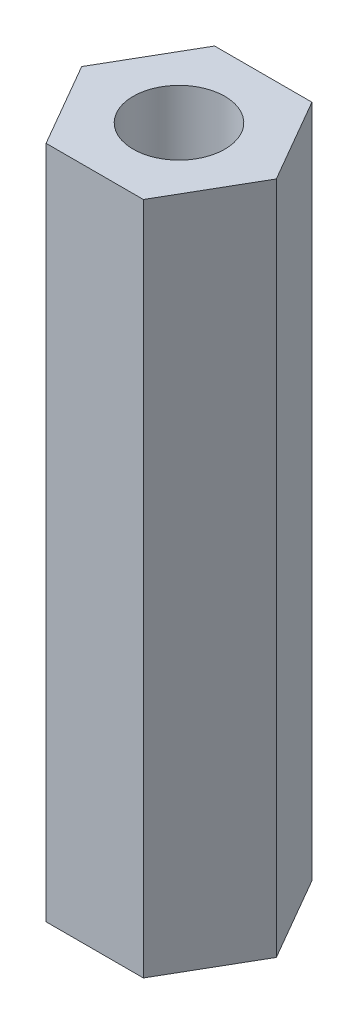
ISO-10303-21;
HEADER;
FILE_DESCRIPTION(('STEP AP214'),'2;1');
FILE_NAME('part.step','',(''),(''),'','','');
FILE_SCHEMA(('AUTOMOTIVE_DESIGN { 1 0 10303 214 1 1 1 1 }'));
ENDSEC;
DATA;
#1=APPLICATION_CONTEXT('core data for automotive mechanical design processes');
#2=APPLICATION_PROTOCOL_DEFINITION('international standard','automotive_design',2000,#1);
#3=PRODUCT_CONTEXT('',#1,'mechanical');
#4=PRODUCT('Part','Part','',(#3));
#5=PRODUCT_RELATED_PRODUCT_CATEGORY('part','',(#4));
#6=PRODUCT_DEFINITION_FORMATION('','',#4);
#7=PRODUCT_DEFINITION_CONTEXT('part definition',#1,'design');
#8=PRODUCT_DEFINITION('design','',#6,#7);
#9=PRODUCT_DEFINITION_SHAPE('','',#8);
#10=(LENGTH_UNIT() NAMED_UNIT(*) SI_UNIT(.MILLI.,.METRE.));
#11=(NAMED_UNIT(*) PLANE_ANGLE_UNIT() SI_UNIT($,.RADIAN.));
#12=(NAMED_UNIT(*) SI_UNIT($,.STERADIAN.) SOLID_ANGLE_UNIT());
#13=UNCERTAINTY_MEASURE_WITH_UNIT(LENGTH_MEASURE(1.E-05),#10,'distance_accuracy_value','');
#14=(GEOMETRIC_REPRESENTATION_CONTEXT(3) GLOBAL_UNCERTAINTY_ASSIGNED_CONTEXT((#13)) GLOBAL_UNIT_ASSIGNED_CONTEXT((#10,
#11,#12)) REPRESENTATION_CONTEXT('',''));
#15=CARTESIAN_POINT('',(0.,0.,0.));
#16=DIRECTION('',(0.,0.,1.));
#17=DIRECTION('',(1.,0.,0.));
#18=AXIS2_PLACEMENT_3D('',#15,#16,#17);
#19=CARTESIAN_POINT('',(1.8330871046771,25.4,3.17499999999998));
#20=DIRECTION('',(-0.866025403784442,0.,-0.499999999999995));
#21=DIRECTION('',(-0.499999999999995,0.,0.866025403784442));
#22=AXIS2_PLACEMENT_3D('',#19,#20,#21);
#23=PLANE('',#22);
#24=DIRECTION('',(0.499999999999995,0.,-0.866025403784442));
#25=VECTOR('',#24,1.);
#26=CARTESIAN_POINT('',(1.8330871046771,0.,3.17499999999998));
#27=LINE('',#26,#25);
#28=CARTESIAN_POINT('',(1.8330871046771,0.,3.17499999999998));
#29=VERTEX_POINT('',#28);
#30=CARTESIAN_POINT('',(3.66617420935413,0.,0.));
#31=VERTEX_POINT('',#30);
#32=EDGE_CURVE('E118',#29,#31,#27,.T.);
#33=ORIENTED_EDGE('',*,*,#32,.T.);
#34=DIRECTION('',(0.,-1.,0.));
#35=VECTOR('',#34,1.);
#36=CARTESIAN_POINT('',(3.66617420935413,25.4,0.));
#37=LINE('',#36,#35);
#38=CARTESIAN_POINT('',(3.66617420935413,25.4,0.));
#39=VERTEX_POINT('',#38);
#40=EDGE_CURVE('E11',#39,#31,#37,.T.);
#41=ORIENTED_EDGE('',*,*,#40,.F.);
#42=DIRECTION('',(0.499999999999995,0.,-0.866025403784442));
#43=VECTOR('',#42,1.);
#44=CARTESIAN_POINT('',(1.8330871046771,25.4,3.17499999999998));
#45=LINE('',#44,#43);
#46=CARTESIAN_POINT('',(1.8330871046771,25.4,3.17499999999998));
#47=VERTEX_POINT('',#46);
#48=EDGE_CURVE('E129',#47,#39,#45,.T.);
#49=ORIENTED_EDGE('',*,*,#48,.F.);
#50=DIRECTION('',(0.,-1.,0.));
#51=VECTOR('',#50,1.);
#52=CARTESIAN_POINT('',(1.8330871046771,25.4,3.17499999999998));
#53=LINE('',#52,#51);
#54=EDGE_CURVE('E114',#47,#29,#53,.T.);
#55=ORIENTED_EDGE('',*,*,#54,.T.);
#56=EDGE_LOOP('',(#33,#41,#49,#55));
#57=FACE_BOUND('',#56,.T.);
#58=ADVANCED_FACE('F34',(#57),#23,.F.);
#59=CARTESIAN_POINT('',(3.66617420935413,25.4,0.));
#60=DIRECTION('',(-0.866025403784438,0.,0.500000000000001));
#61=DIRECTION('',(0.500000000000001,0.,0.866025403784438));
#62=AXIS2_PLACEMENT_3D('',#59,#60,#61);
#63=PLANE('',#62);
#64=DIRECTION('',(-0.500000000000001,0.,-0.866025403784438));
#65=VECTOR('',#64,1.);
#66=CARTESIAN_POINT('',(3.66617420935413,0.,0.));
#67=LINE('',#66,#65);
#68=CARTESIAN_POINT('',(1.83308710467706,0.,-3.17500000000001));
#69=VERTEX_POINT('',#68);
#70=EDGE_CURVE('E121',#31,#69,#67,.T.);
#71=ORIENTED_EDGE('',*,*,#70,.T.);
#72=DIRECTION('',(0.,-1.,0.));
#73=VECTOR('',#72,1.);
#74=CARTESIAN_POINT('',(1.83308710467706,25.4,-3.17500000000001));
#75=LINE('',#74,#73);
#76=CARTESIAN_POINT('',(1.83308710467706,25.4,-3.17500000000001));
#77=VERTEX_POINT('',#76);
#78=EDGE_CURVE('E42',#77,#69,#75,.T.);
#79=ORIENTED_EDGE('',*,*,#78,.F.);
#80=DIRECTION('',(-0.500000000000001,0.,-0.866025403784438));
#81=VECTOR('',#80,1.);
#82=CARTESIAN_POINT('',(3.66617420935413,25.4,0.));
#83=LINE('',#82,#81);
#84=EDGE_CURVE('E87',#39,#77,#83,.T.);
#85=ORIENTED_EDGE('',*,*,#84,.F.);
#86=ORIENTED_EDGE('',*,*,#40,.T.);
#87=EDGE_LOOP('',(#71,#79,#85,#86));
#88=FACE_BOUND('',#87,.T.);
#89=ADVANCED_FACE('F154',(#88),#63,.F.);
#90=CARTESIAN_POINT('',(1.83308710467706,25.4,-3.17500000000001));
#91=DIRECTION('',(0.,0.,1.));
#92=DIRECTION('',(1.,0.,0.));
#93=AXIS2_PLACEMENT_3D('',#90,#91,#92);
#94=PLANE('',#93);
#95=DIRECTION('',(-1.,0.,0.));
#96=VECTOR('',#95,1.);
#97=CARTESIAN_POINT('',(1.83308710467706,0.,-3.17500000000001));
#98=LINE('',#97,#96);
#99=CARTESIAN_POINT('',(-1.83308710467708,0.,-3.17499999999999));
#100=VERTEX_POINT('',#99);
#101=EDGE_CURVE('E124',#69,#100,#98,.T.);
#102=ORIENTED_EDGE('',*,*,#101,.T.);
#103=DIRECTION('',(0.,-1.,0.));
#104=VECTOR('',#103,1.);
#105=CARTESIAN_POINT('',(-1.83308710467708,25.4,-3.17499999999999));
#106=LINE('',#105,#104);
#107=CARTESIAN_POINT('',(-1.83308710467708,25.4,-3.17499999999999));
#108=VERTEX_POINT('',#107);
#109=EDGE_CURVE('E109',#108,#100,#106,.T.);
#110=ORIENTED_EDGE('',*,*,#109,.F.);
#111=DIRECTION('',(-1.,0.,0.));
#112=VECTOR('',#111,1.);
#113=CARTESIAN_POINT('',(1.83308710467706,25.4,-3.17500000000001));
#114=LINE('',#113,#112);
#115=EDGE_CURVE('E100',#77,#108,#114,.T.);
#116=ORIENTED_EDGE('',*,*,#115,.F.);
#117=ORIENTED_EDGE('',*,*,#78,.T.);
#118=EDGE_LOOP('',(#102,#110,#116,#117));
#119=FACE_BOUND('',#118,.T.);
#120=ADVANCED_FACE('F135',(#119),#94,.F.);
#121=CARTESIAN_POINT('',(-1.83308710467708,25.4,-3.17499999999999));
#122=DIRECTION('',(0.866025403784441,0.,0.499999999999995));
#123=DIRECTION('',(0.499999999999995,0.,-0.866025403784441));
#124=AXIS2_PLACEMENT_3D('',#121,#122,#123);
#125=PLANE('',#124);
#126=DIRECTION('',(-0.499999999999995,0.,0.866025403784441));
#127=VECTOR('',#126,1.);
#128=CARTESIAN_POINT('',(-1.83308710467708,0.,-3.17499999999999));
#129=LINE('',#128,#127);
#130=CARTESIAN_POINT('',(-3.66617420935413,0.,0.));
#131=VERTEX_POINT('',#130);
#132=EDGE_CURVE('E108',#100,#131,#129,.T.);
#133=ORIENTED_EDGE('',*,*,#132,.T.);
#134=DIRECTION('',(0.,-1.,0.));
#135=VECTOR('',#134,1.);
#136=CARTESIAN_POINT('',(-3.66617420935413,25.4,0.));
#137=LINE('',#136,#135);
#138=CARTESIAN_POINT('',(-3.66617420935413,25.4,0.));
#139=VERTEX_POINT('',#138);
#140=EDGE_CURVE('E105',#139,#131,#137,.T.);
#141=ORIENTED_EDGE('',*,*,#140,.F.);
#142=DIRECTION('',(-0.499999999999995,0.,0.866025403784441));
#143=VECTOR('',#142,1.);
#144=CARTESIAN_POINT('',(-1.83308710467708,25.4,-3.17499999999999));
#145=LINE('',#144,#143);
#146=EDGE_CURVE('E94',#108,#139,#145,.T.);
#147=ORIENTED_EDGE('',*,*,#146,.F.);
#148=ORIENTED_EDGE('',*,*,#109,.T.);
#149=EDGE_LOOP('',(#133,#141,#147,#148));
#150=FACE_BOUND('',#149,.T.);
#151=ADVANCED_FACE('F106',(#150),#125,.F.);
#152=CARTESIAN_POINT('',(-3.66617420935413,25.4,0.));
#153=DIRECTION('',(0.866025403784435,0.,-0.500000000000007));
#154=DIRECTION('',(-0.500000000000007,0.,-0.866025403784435));
#155=AXIS2_PLACEMENT_3D('',#152,#153,#154);
#156=PLANE('',#155);
#157=DIRECTION('',(0.500000000000007,0.,0.866025403784435));
#158=VECTOR('',#157,1.);
#159=CARTESIAN_POINT('',(-3.66617420935413,0.,0.));
#160=LINE('',#159,#158);
#161=CARTESIAN_POINT('',(-1.83308710467703,0.,3.17500000000002));
#162=VERTEX_POINT('',#161);
#163=EDGE_CURVE('E73',#131,#162,#160,.T.);
#164=ORIENTED_EDGE('',*,*,#163,.T.);
#165=DIRECTION('',(0.,-1.,0.));
#166=VECTOR('',#165,1.);
#167=CARTESIAN_POINT('',(-1.83308710467703,25.4,3.17500000000002));
#168=LINE('',#167,#166);
#169=CARTESIAN_POINT('',(-1.83308710467703,25.4,3.17500000000002));
#170=VERTEX_POINT('',#169);
#171=EDGE_CURVE('E110',#170,#162,#168,.T.);
#172=ORIENTED_EDGE('',*,*,#171,.F.);
#173=DIRECTION('',(0.500000000000007,0.,0.866025403784435));
#174=VECTOR('',#173,1.);
#175=CARTESIAN_POINT('',(-3.66617420935413,25.4,0.));
#176=LINE('',#175,#174);
#177=EDGE_CURVE('E98',#139,#170,#176,.T.);
#178=ORIENTED_EDGE('',*,*,#177,.F.);
#179=ORIENTED_EDGE('',*,*,#140,.T.);
#180=EDGE_LOOP('',(#164,#172,#178,#179));
#181=FACE_BOUND('',#180,.T.);
#182=ADVANCED_FACE('F112',(#181),#156,.F.);
#183=CARTESIAN_POINT('',(-1.83308710467703,25.4,3.17500000000002));
#184=DIRECTION('',(0.,0.,-1.));
#185=DIRECTION('',(-1.,0.,0.));
#186=AXIS2_PLACEMENT_3D('',#183,#184,#185);
#187=PLANE('',#186);
#188=DIRECTION('',(1.,0.,0.));
#189=VECTOR('',#188,1.);
#190=CARTESIAN_POINT('',(-1.83308710467703,0.,3.17500000000002));
#191=LINE('',#190,#189);
#192=EDGE_CURVE('E79',#162,#29,#191,.T.);
#193=ORIENTED_EDGE('',*,*,#192,.T.);
#194=ORIENTED_EDGE('',*,*,#54,.F.);
#195=DIRECTION('',(1.,0.,0.));
#196=VECTOR('',#195,1.);
#197=CARTESIAN_POINT('',(-1.83308710467703,25.4,3.17500000000002));
#198=LINE('',#197,#196);
#199=EDGE_CURVE('E50',#170,#47,#198,.T.);
#200=ORIENTED_EDGE('',*,*,#199,.F.);
#201=ORIENTED_EDGE('',*,*,#171,.T.);
#202=EDGE_LOOP('',(#193,#194,#200,#201));
#203=FACE_BOUND('',#202,.T.);
#204=ADVANCED_FACE('F142',(#203),#187,.F.);
#205=CARTESIAN_POINT('',(0.,25.4,0.));
#206=DIRECTION('',(0.,1.,0.));
#207=DIRECTION('',(0.,0.,1.));
#208=AXIS2_PLACEMENT_3D('',#205,#206,#207);
#209=PLANE('',#208);
#210=CARTESIAN_POINT('',(0.,25.4,0.));
#211=DIRECTION('',(0.,-1.,0.));
#212=DIRECTION('',(0.,0.,-1.));
#213=AXIS2_PLACEMENT_3D('',#210,#211,#212);
#214=CIRCLE('',#213,1.72719999999999);
#215=CARTESIAN_POINT('',(0.,25.4,-1.72719999999999));
#216=VERTEX_POINT('',#215);
#217=EDGE_CURVE('E122',#216,#216,#214,.T.);
#218=ORIENTED_EDGE('',*,*,#217,.T.);
#219=EDGE_LOOP('',(#218));
#220=FACE_BOUND('',#219,.T.);
#221=ORIENTED_EDGE('',*,*,#48,.T.);
#222=ORIENTED_EDGE('',*,*,#84,.T.);
#223=ORIENTED_EDGE('',*,*,#115,.T.);
#224=ORIENTED_EDGE('',*,*,#146,.T.);
#225=ORIENTED_EDGE('',*,*,#177,.T.);
#226=ORIENTED_EDGE('',*,*,#199,.T.);
#227=EDGE_LOOP('',(#221,#222,#223,#224,#225,#226));
#228=FACE_BOUND('',#227,.T.);
#229=ADVANCED_FACE('F96',(#220,#228),#209,.T.);
#230=CARTESIAN_POINT('',(0.,0.,0.));
#231=DIRECTION('',(0.,1.,0.));
#232=DIRECTION('',(0.,0.,1.));
#233=AXIS2_PLACEMENT_3D('',#230,#231,#232);
#234=PLANE('',#233);
#235=CARTESIAN_POINT('',(0.,0.,0.));
#236=DIRECTION('',(0.,-1.,0.));
#237=DIRECTION('',(0.,0.,-1.));
#238=AXIS2_PLACEMENT_3D('',#235,#236,#237);
#239=CIRCLE('',#238,1.72719999999999);
#240=CARTESIAN_POINT('',(0.,0.,-1.72719999999999));
#241=VERTEX_POINT('',#240);
#242=EDGE_CURVE('E211',#241,#241,#239,.T.);
#243=ORIENTED_EDGE('',*,*,#242,.F.);
#244=EDGE_LOOP('',(#243));
#245=FACE_BOUND('',#244,.T.);
#246=ORIENTED_EDGE('',*,*,#32,.F.);
#247=ORIENTED_EDGE('',*,*,#192,.F.);
#248=ORIENTED_EDGE('',*,*,#163,.F.);
#249=ORIENTED_EDGE('',*,*,#132,.F.);
#250=ORIENTED_EDGE('',*,*,#101,.F.);
#251=ORIENTED_EDGE('',*,*,#70,.F.);
#252=EDGE_LOOP('',(#246,#247,#248,#249,#250,#251));
#253=FACE_BOUND('',#252,.T.);
#254=ADVANCED_FACE('F138',(#245,#253),#234,.F.);
#255=CARTESIAN_POINT('',(0.,0.,0.));
#256=DIRECTION('',(0.,-1.,0.));
#257=DIRECTION('',(0.,0.,-1.));
#258=AXIS2_PLACEMENT_3D('',#255,#256,#257);
#259=CYLINDRICAL_SURFACE('',#258,1.72719999999999);
#260=ORIENTED_EDGE('',*,*,#217,.F.);
#261=EDGE_LOOP('',(#260));
#262=FACE_BOUND('',#261,.T.);
#263=ORIENTED_EDGE('',*,*,#242,.T.);
#264=EDGE_LOOP('',(#263));
#265=FACE_BOUND('',#264,.T.);
#266=ADVANCED_FACE('F191',(#262,#265),#259,.F.);
#267=CLOSED_SHELL('',(#58,#89,#120,#151,#182,#204,#229,#254,#266));
#268=MANIFOLD_SOLID_BREP('B2',#267);
#269=ADVANCED_BREP_SHAPE_REPRESENTATION('',(#18,#268),#14);
#270=SHAPE_DEFINITION_REPRESENTATION(#9,#269);
ENDSEC;
END-ISO-10303-21;
